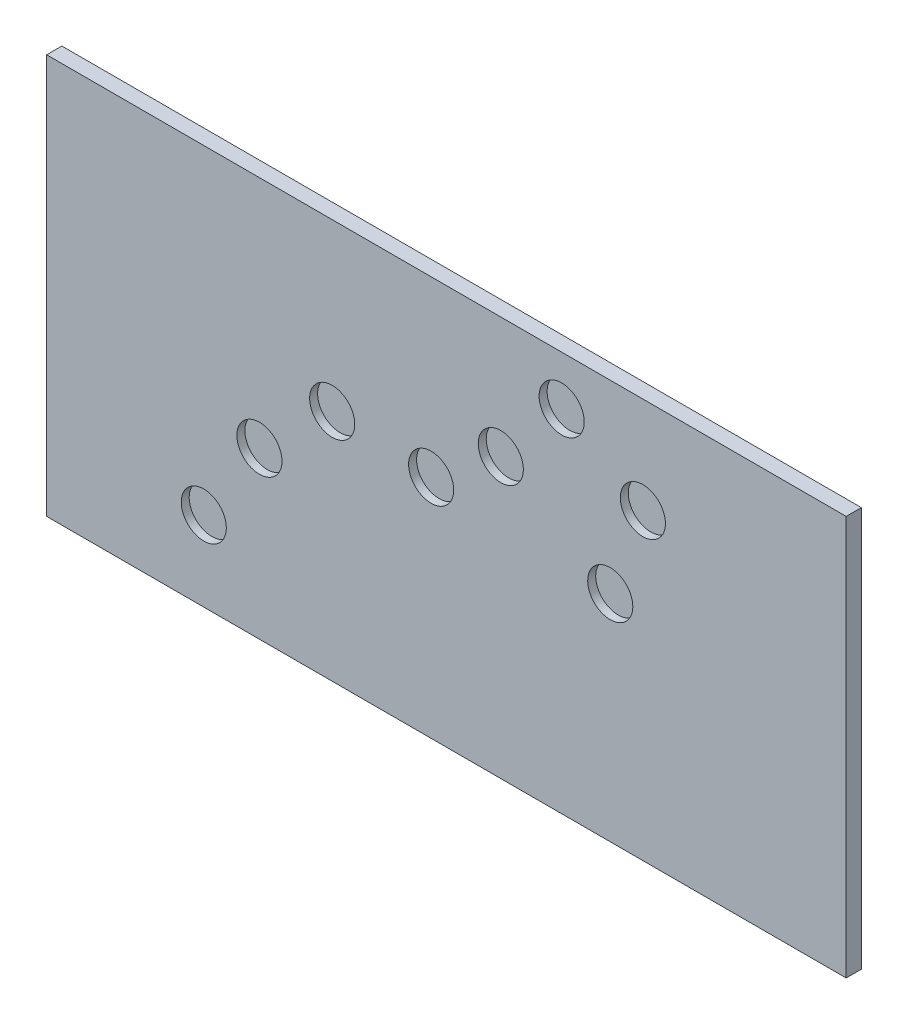
ISO-10303-21;
HEADER;
FILE_DESCRIPTION(('STEP AP214'),'2;1');
FILE_NAME('part.step','',(''),(''),'','','');
FILE_SCHEMA(('AUTOMOTIVE_DESIGN { 1 0 10303 214 1 1 1 1 }'));
ENDSEC;
DATA;
#1=APPLICATION_CONTEXT('core data for automotive mechanical design processes');
#2=APPLICATION_PROTOCOL_DEFINITION('international standard','automotive_design',2000,#1);
#3=PRODUCT_CONTEXT('',#1,'mechanical');
#4=PRODUCT('Part','Part','',(#3));
#5=PRODUCT_RELATED_PRODUCT_CATEGORY('part','',(#4));
#6=PRODUCT_DEFINITION_FORMATION('','',#4);
#7=PRODUCT_DEFINITION_CONTEXT('part definition',#1,'design');
#8=PRODUCT_DEFINITION('design','',#6,#7);
#9=PRODUCT_DEFINITION_SHAPE('','',#8);
#10=(LENGTH_UNIT() NAMED_UNIT(*) SI_UNIT(.MILLI.,.METRE.));
#11=(NAMED_UNIT(*) PLANE_ANGLE_UNIT() SI_UNIT($,.RADIAN.));
#12=(NAMED_UNIT(*) SI_UNIT($,.STERADIAN.) SOLID_ANGLE_UNIT());
#13=UNCERTAINTY_MEASURE_WITH_UNIT(LENGTH_MEASURE(1.E-05),#10,'distance_accuracy_value','');
#14=(GEOMETRIC_REPRESENTATION_CONTEXT(3) GLOBAL_UNCERTAINTY_ASSIGNED_CONTEXT((#13)) GLOBAL_UNIT_ASSIGNED_CONTEXT((#10,
#11,#12)) REPRESENTATION_CONTEXT('',''));
#15=CARTESIAN_POINT('',(0.,0.,0.));
#16=DIRECTION('',(0.,0.,1.));
#17=DIRECTION('',(1.,0.,0.));
#18=AXIS2_PLACEMENT_3D('',#15,#16,#17);
#19=CARTESIAN_POINT('',(0.,0.,19.));
#20=DIRECTION('',(1.,0.,0.));
#21=DIRECTION('',(0.,0.,-1.));
#22=AXIS2_PLACEMENT_3D('',#19,#20,#21);
#23=PLANE('',#22);
#24=DIRECTION('',(0.,-1.,0.));
#25=VECTOR('',#24,1.);
#26=CARTESIAN_POINT('',(0.,0.,0.));
#27=LINE('',#26,#25);
#28=CARTESIAN_POINT('',(0.,500.,0.));
#29=VERTEX_POINT('',#28);
#30=CARTESIAN_POINT('',(0.,0.,0.));
#31=VERTEX_POINT('',#30);
#32=EDGE_CURVE('E131',#29,#31,#27,.T.);
#33=ORIENTED_EDGE('',*,*,#32,.T.);
#34=DIRECTION('',(0.,0.,-1.));
#35=VECTOR('',#34,1.);
#36=CARTESIAN_POINT('',(0.,0.,19.));
#37=LINE('',#36,#35);
#38=CARTESIAN_POINT('',(0.,0.,19.));
#39=VERTEX_POINT('',#38);
#40=EDGE_CURVE('E13',#39,#31,#37,.T.);
#41=ORIENTED_EDGE('',*,*,#40,.F.);
#42=DIRECTION('',(0.,-1.,0.));
#43=VECTOR('',#42,1.);
#44=CARTESIAN_POINT('',(0.,0.,19.));
#45=LINE('',#44,#43);
#46=CARTESIAN_POINT('',(0.,500.,19.));
#47=VERTEX_POINT('',#46);
#48=EDGE_CURVE('E119',#47,#39,#45,.T.);
#49=ORIENTED_EDGE('',*,*,#48,.F.);
#50=DIRECTION('',(0.,0.,-1.));
#51=VECTOR('',#50,1.);
#52=CARTESIAN_POINT('',(0.,500.,19.));
#53=LINE('',#52,#51);
#54=EDGE_CURVE('E127',#47,#29,#53,.T.);
#55=ORIENTED_EDGE('',*,*,#54,.T.);
#56=EDGE_LOOP('',(#33,#41,#49,#55));
#57=FACE_BOUND('',#56,.T.);
#58=ADVANCED_FACE('F68',(#57),#23,.F.);
#59=CARTESIAN_POINT('',(0.,0.,19.));
#60=DIRECTION('',(0.,1.,0.));
#61=DIRECTION('',(0.,0.,1.));
#62=AXIS2_PLACEMENT_3D('',#59,#60,#61);
#63=PLANE('',#62);
#64=DIRECTION('',(1.,0.,0.));
#65=VECTOR('',#64,1.);
#66=CARTESIAN_POINT('',(0.,0.,0.));
#67=LINE('',#66,#65);
#68=CARTESIAN_POINT('',(1000.,0.,0.));
#69=VERTEX_POINT('',#68);
#70=EDGE_CURVE('E123',#31,#69,#67,.T.);
#71=ORIENTED_EDGE('',*,*,#70,.T.);
#72=DIRECTION('',(0.,0.,-1.));
#73=VECTOR('',#72,1.);
#74=CARTESIAN_POINT('',(1000.,0.,19.));
#75=LINE('',#74,#73);
#76=CARTESIAN_POINT('',(1000.,0.,19.));
#77=VERTEX_POINT('',#76);
#78=EDGE_CURVE('E76',#77,#69,#75,.T.);
#79=ORIENTED_EDGE('',*,*,#78,.F.);
#80=DIRECTION('',(1.,0.,0.));
#81=VECTOR('',#80,1.);
#82=CARTESIAN_POINT('',(0.,0.,19.));
#83=LINE('',#82,#81);
#84=EDGE_CURVE('E114',#39,#77,#83,.T.);
#85=ORIENTED_EDGE('',*,*,#84,.F.);
#86=ORIENTED_EDGE('',*,*,#40,.T.);
#87=EDGE_LOOP('',(#71,#79,#85,#86));
#88=FACE_BOUND('',#87,.T.);
#89=ADVANCED_FACE('F122',(#88),#63,.F.);
#90=CARTESIAN_POINT('',(1000.,0.,19.));
#91=DIRECTION('',(-1.,0.,0.));
#92=DIRECTION('',(0.,0.,1.));
#93=AXIS2_PLACEMENT_3D('',#90,#91,#92);
#94=PLANE('',#93);
#95=DIRECTION('',(0.,1.,0.));
#96=VECTOR('',#95,1.);
#97=CARTESIAN_POINT('',(1000.,0.,0.));
#98=LINE('',#97,#96);
#99=CARTESIAN_POINT('',(1000.,500.,0.));
#100=VERTEX_POINT('',#99);
#101=EDGE_CURVE('E101',#69,#100,#98,.T.);
#102=ORIENTED_EDGE('',*,*,#101,.T.);
#103=DIRECTION('',(0.,0.,-1.));
#104=VECTOR('',#103,1.);
#105=CARTESIAN_POINT('',(1000.,500.,19.));
#106=LINE('',#105,#104);
#107=CARTESIAN_POINT('',(1000.,500.,19.));
#108=VERTEX_POINT('',#107);
#109=EDGE_CURVE('E124',#108,#100,#106,.T.);
#110=ORIENTED_EDGE('',*,*,#109,.F.);
#111=DIRECTION('',(0.,1.,0.));
#112=VECTOR('',#111,1.);
#113=CARTESIAN_POINT('',(1000.,0.,19.));
#114=LINE('',#113,#112);
#115=EDGE_CURVE('E117',#77,#108,#114,.T.);
#116=ORIENTED_EDGE('',*,*,#115,.F.);
#117=ORIENTED_EDGE('',*,*,#78,.T.);
#118=EDGE_LOOP('',(#102,#110,#116,#117));
#119=FACE_BOUND('',#118,.T.);
#120=ADVANCED_FACE('F125',(#119),#94,.F.);
#121=CARTESIAN_POINT('',(0.,500.,19.));
#122=DIRECTION('',(0.,-1.,0.));
#123=DIRECTION('',(0.,0.,-1.));
#124=AXIS2_PLACEMENT_3D('',#121,#122,#123);
#125=PLANE('',#124);
#126=DIRECTION('',(-1.,0.,0.));
#127=VECTOR('',#126,1.);
#128=CARTESIAN_POINT('',(0.,500.,0.));
#129=LINE('',#128,#127);
#130=EDGE_CURVE('E107',#100,#29,#129,.T.);
#131=ORIENTED_EDGE('',*,*,#130,.T.);
#132=ORIENTED_EDGE('',*,*,#54,.F.);
#133=DIRECTION('',(-1.,0.,0.));
#134=VECTOR('',#133,1.);
#135=CARTESIAN_POINT('',(0.,500.,19.));
#136=LINE('',#135,#134);
#137=EDGE_CURVE('E84',#108,#47,#136,.T.);
#138=ORIENTED_EDGE('',*,*,#137,.F.);
#139=ORIENTED_EDGE('',*,*,#109,.T.);
#140=EDGE_LOOP('',(#131,#132,#138,#139));
#141=FACE_BOUND('',#140,.T.);
#142=ADVANCED_FACE('F139',(#141),#125,.F.);
#143=CARTESIAN_POINT('',(0.,500.,19.));
#144=DIRECTION('',(0.,0.,-1.));
#145=DIRECTION('',(-1.,0.,0.));
#146=AXIS2_PLACEMENT_3D('',#143,#144,#145);
#147=PLANE('',#146);
#148=CARTESIAN_POINT('',(357.149463479894,292.373242422048,19.));
#149=DIRECTION('',(0.,0.,1.));
#150=DIRECTION('',(0.798681998165496,-0.601753326377487,0.));
#151=AXIS2_PLACEMENT_3D('',#148,#149,#150);
#152=CIRCLE('',#151,28.2123499760019);
#153=CARTESIAN_POINT('',(379.682159531671,275.396366979063,19.));
#154=VERTEX_POINT('',#153);
#155=EDGE_CURVE('E185',#154,#154,#152,.T.);
#156=ORIENTED_EDGE('',*,*,#155,.F.);
#157=EDGE_LOOP('',(#156));
#158=FACE_BOUND('',#157,.T.);
#159=CARTESIAN_POINT('',(480.935862348049,282.89072122934,19.));
#160=DIRECTION('',(0.,0.,1.));
#161=DIRECTION('',(0.265853347136616,-0.964013484250224,0.));
#162=AXIS2_PLACEMENT_3D('',#159,#160,#161);
#163=CIRCLE('',#162,28.2123499760019);
#164=CARTESIAN_POINT('',(488.436210019759,255.693635430087,19.));
#165=VERTEX_POINT('',#164);
#166=EDGE_CURVE('E179',#165,#165,#163,.T.);
#167=ORIENTED_EDGE('',*,*,#166,.F.);
#168=EDGE_LOOP('',(#167));
#169=FACE_BOUND('',#168,.T.);
#170=CARTESIAN_POINT('',(568.014776537445,348.810476341382,19.));
#171=DIRECTION('',(0.,0.,1.));
#172=DIRECTION('',(0.841752833044578,0.539863101222363,0.));
#173=AXIS2_PLACEMENT_3D('',#170,#171,#172);
#174=CIRCLE('',#173,28.2123499760019);
#175=CARTESIAN_POINT('',(591.76260205659,364.041283092197,19.));
#176=VERTEX_POINT('',#175);
#177=EDGE_CURVE('E173',#176,#176,#174,.T.);
#178=ORIENTED_EDGE('',*,*,#177,.F.);
#179=EDGE_LOOP('',(#178));
#180=FACE_BOUND('',#179,.T.);
#181=CARTESIAN_POINT('',(644.156581304666,438.482891969957,19.));
#182=DIRECTION('',(0.,0.,1.));
#183=DIRECTION('',(0.678144469858808,-0.734928621023781,0.));
#184=AXIS2_PLACEMENT_3D('',#181,#182,#183);
#185=CIRCLE('',#184,28.2123499760019);
#186=CARTESIAN_POINT('',(663.288630422613,417.748828506254,19.));
#187=VERTEX_POINT('',#186);
#188=EDGE_CURVE('E167',#187,#187,#185,.T.);
#189=ORIENTED_EDGE('',*,*,#188,.F.);
#190=EDGE_LOOP('',(#189));
#191=FACE_BOUND('',#190,.T.);
#192=CARTESIAN_POINT('',(745.713948150023,379.112715978041,19.));
#193=DIRECTION('',(0.,0.,1.));
#194=DIRECTION('',(-0.605664723776337,-0.795719952227499,0.));
#195=AXIS2_PLACEMENT_3D('',#192,#193,#194);
#196=CIRCLE('',#195,28.2123499760019);
#197=CARTESIAN_POINT('',(728.626722994727,356.663586202912,19.));
#198=VERTEX_POINT('',#197);
#199=EDGE_CURVE('E160',#198,#198,#196,.T.);
#200=ORIENTED_EDGE('',*,*,#199,.F.);
#201=EDGE_LOOP('',(#200));
#202=FACE_BOUND('',#201,.T.);
#203=CARTESIAN_POINT('',(704.928159374163,268.771264148711,19.));
#204=DIRECTION('',(0.,0.,1.));
#205=DIRECTION('',(-0.88899959858468,0.457907975161252,0.));
#206=AXIS2_PLACEMENT_3D('',#203,#204,#205);
#207=CIRCLE('',#206,28.2123499760019);
#208=CARTESIAN_POINT('',(679.847391570366,281.689924200763,19.));
#209=VERTEX_POINT('',#208);
#210=EDGE_CURVE('E161',#209,#209,#207,.T.);
#211=ORIENTED_EDGE('',*,*,#210,.F.);
#212=EDGE_LOOP('',(#211));
#213=FACE_BOUND('',#212,.T.);
#214=CARTESIAN_POINT('',(266.151257789515,206.876350005216,19.));
#215=DIRECTION('',(0.,0.,1.));
#216=DIRECTION('',(1.,0.,0.));
#217=AXIS2_PLACEMENT_3D('',#214,#215,#216);
#218=CIRCLE('',#217,28.2123499760019);
#219=CARTESIAN_POINT('',(294.363607765517,206.876350005216,19.));
#220=VERTEX_POINT('',#219);
#221=EDGE_CURVE('E153',#220,#220,#218,.T.);
#222=ORIENTED_EDGE('',*,*,#221,.F.);
#223=EDGE_LOOP('',(#222));
#224=FACE_BOUND('',#223,.T.);
#225=CARTESIAN_POINT('',(196.527870487984,99.7537968748645,19.));
#226=DIRECTION('',(0.,0.,1.));
#227=DIRECTION('',(1.,0.,0.));
#228=AXIS2_PLACEMENT_3D('',#225,#226,#227);
#229=CIRCLE('',#228,28.2123499760019);
#230=CARTESIAN_POINT('',(224.740220463985,99.7537968748645,19.));
#231=VERTEX_POINT('',#230);
#232=EDGE_CURVE('E145',#231,#231,#229,.T.);
#233=ORIENTED_EDGE('',*,*,#232,.F.);
#234=EDGE_LOOP('',(#233));
#235=FACE_BOUND('',#234,.T.);
#236=ORIENTED_EDGE('',*,*,#48,.T.);
#237=ORIENTED_EDGE('',*,*,#84,.T.);
#238=ORIENTED_EDGE('',*,*,#115,.T.);
#239=ORIENTED_EDGE('',*,*,#137,.T.);
#240=EDGE_LOOP('',(#236,#237,#238,#239));
#241=FACE_BOUND('',#240,.T.);
#242=ADVANCED_FACE('F115',(#158,#169,#180,#191,#202,#213,#224,#235,#241),#147,.F.);
#243=CARTESIAN_POINT('',(0.,500.,0.));
#244=DIRECTION('',(0.,0.,-1.));
#245=DIRECTION('',(-1.,0.,0.));
#246=AXIS2_PLACEMENT_3D('',#243,#244,#245);
#247=PLANE('',#246);
#248=ORIENTED_EDGE('',*,*,#32,.F.);
#249=ORIENTED_EDGE('',*,*,#130,.F.);
#250=ORIENTED_EDGE('',*,*,#101,.F.);
#251=ORIENTED_EDGE('',*,*,#70,.F.);
#252=EDGE_LOOP('',(#248,#249,#250,#251));
#253=FACE_BOUND('',#252,.T.);
#254=ADVANCED_FACE('F142',(#253),#247,.T.);
#255=CARTESIAN_POINT('',(196.527870487984,99.7537968748645,9.));
#256=DIRECTION('',(0.,0.,1.));
#257=DIRECTION('',(1.,0.,0.));
#258=AXIS2_PLACEMENT_3D('',#255,#256,#257);
#259=CYLINDRICAL_SURFACE('',#258,28.2123499760019);
#260=CARTESIAN_POINT('',(196.527870487984,99.7537968748645,9.));
#261=DIRECTION('',(0.,0.,1.));
#262=DIRECTION('',(1.,0.,0.));
#263=AXIS2_PLACEMENT_3D('',#260,#261,#262);
#264=CIRCLE('',#263,28.2123499760019);
#265=CARTESIAN_POINT('',(224.740220463985,99.7537968748645,9.));
#266=VERTEX_POINT('',#265);
#267=EDGE_CURVE('E134',#266,#266,#264,.T.);
#268=ORIENTED_EDGE('',*,*,#267,.F.);
#269=EDGE_LOOP('',(#268));
#270=FACE_BOUND('',#269,.T.);
#271=ORIENTED_EDGE('',*,*,#232,.T.);
#272=EDGE_LOOP('',(#271));
#273=FACE_BOUND('',#272,.T.);
#274=ADVANCED_FACE('F212',(#270,#273),#259,.F.);
#275=CARTESIAN_POINT('',(196.527870487984,99.7537968748645,9.));
#276=DIRECTION('',(0.,0.,1.));
#277=DIRECTION('',(1.,0.,0.));
#278=AXIS2_PLACEMENT_3D('',#275,#276,#277);
#279=PLANE('',#278);
#280=ORIENTED_EDGE('',*,*,#267,.T.);
#281=EDGE_LOOP('',(#280));
#282=FACE_BOUND('',#281,.T.);
#283=ADVANCED_FACE('F214',(#282),#279,.T.);
#284=CARTESIAN_POINT('',(266.151257789515,206.876350005216,9.00000000000003));
#285=DIRECTION('',(0.,0.,1.));
#286=DIRECTION('',(1.,0.,0.));
#287=AXIS2_PLACEMENT_3D('',#284,#285,#286);
#288=CYLINDRICAL_SURFACE('',#287,28.2123499760019);
#289=CARTESIAN_POINT('',(266.151257789515,206.876350005216,9.00000000000003));
#290=DIRECTION('',(0.,0.,1.));
#291=DIRECTION('',(1.,0.,0.));
#292=AXIS2_PLACEMENT_3D('',#289,#290,#291);
#293=CIRCLE('',#292,28.2123499760019);
#294=CARTESIAN_POINT('',(294.363607765517,206.876350005216,9.00000000000003));
#295=VERTEX_POINT('',#294);
#296=EDGE_CURVE('E148',#295,#295,#293,.T.);
#297=ORIENTED_EDGE('',*,*,#296,.F.);
#298=EDGE_LOOP('',(#297));
#299=FACE_BOUND('',#298,.T.);
#300=ORIENTED_EDGE('',*,*,#221,.T.);
#301=EDGE_LOOP('',(#300));
#302=FACE_BOUND('',#301,.T.);
#303=ADVANCED_FACE('F221',(#299,#302),#288,.F.);
#304=CARTESIAN_POINT('',(266.151257789515,206.876350005216,9.00000000000003));
#305=DIRECTION('',(0.,0.,1.));
#306=DIRECTION('',(1.,0.,0.));
#307=AXIS2_PLACEMENT_3D('',#304,#305,#306);
#308=PLANE('',#307);
#309=ORIENTED_EDGE('',*,*,#296,.T.);
#310=EDGE_LOOP('',(#309));
#311=FACE_BOUND('',#310,.T.);
#312=ADVANCED_FACE('F267',(#311),#308,.T.);
#313=CARTESIAN_POINT('',(704.928159374163,268.771264148711,9.00000000000003));
#314=DIRECTION('',(0.,0.,1.));
#315=DIRECTION('',(-0.88899959858468,0.457907975161252,0.));
#316=AXIS2_PLACEMENT_3D('',#313,#314,#315);
#317=CYLINDRICAL_SURFACE('',#316,28.2123499760019);
#318=CARTESIAN_POINT('',(704.928159374163,268.771264148711,9.00000000000003));
#319=DIRECTION('',(0.,0.,1.));
#320=DIRECTION('',(-0.88899959858468,0.457907975161252,0.));
#321=AXIS2_PLACEMENT_3D('',#318,#319,#320);
#322=CIRCLE('',#321,28.2123499760019);
#323=CARTESIAN_POINT('',(679.847391570366,281.689924200763,9.00000000000003));
#324=VERTEX_POINT('',#323);
#325=EDGE_CURVE('E157',#324,#324,#322,.T.);
#326=ORIENTED_EDGE('',*,*,#325,.F.);
#327=EDGE_LOOP('',(#326));
#328=FACE_BOUND('',#327,.T.);
#329=ORIENTED_EDGE('',*,*,#210,.T.);
#330=EDGE_LOOP('',(#329));
#331=FACE_BOUND('',#330,.T.);
#332=ADVANCED_FACE('F274',(#328,#331),#317,.F.);
#333=CARTESIAN_POINT('',(704.928159374163,268.771264148711,9.00000000000003));
#334=DIRECTION('',(0.,0.,1.));
#335=DIRECTION('',(-0.88899959858468,0.457907975161252,0.));
#336=AXIS2_PLACEMENT_3D('',#333,#334,#335);
#337=PLANE('',#336);
#338=ORIENTED_EDGE('',*,*,#325,.T.);
#339=EDGE_LOOP('',(#338));
#340=FACE_BOUND('',#339,.T.);
#341=ADVANCED_FACE('F282',(#340),#337,.T.);
#342=CARTESIAN_POINT('',(745.713948150023,379.112715978041,9.00000000000003));
#343=DIRECTION('',(0.,0.,1.));
#344=DIRECTION('',(-0.605664723776337,-0.795719952227499,0.));
#345=AXIS2_PLACEMENT_3D('',#342,#343,#344);
#346=CYLINDRICAL_SURFACE('',#345,28.2123499760019);
#347=CARTESIAN_POINT('',(745.713948150023,379.112715978041,9.00000000000003));
#348=DIRECTION('',(0.,0.,1.));
#349=DIRECTION('',(-0.605664723776337,-0.795719952227499,0.));
#350=AXIS2_PLACEMENT_3D('',#347,#348,#349);
#351=CIRCLE('',#350,28.2123499760019);
#352=CARTESIAN_POINT('',(728.626722994727,356.663586202912,9.00000000000003));
#353=VERTEX_POINT('',#352);
#354=EDGE_CURVE('E164',#353,#353,#351,.T.);
#355=ORIENTED_EDGE('',*,*,#354,.F.);
#356=EDGE_LOOP('',(#355));
#357=FACE_BOUND('',#356,.T.);
#358=ORIENTED_EDGE('',*,*,#199,.T.);
#359=EDGE_LOOP('',(#358));
#360=FACE_BOUND('',#359,.T.);
#361=ADVANCED_FACE('F290',(#357,#360),#346,.F.);
#362=CARTESIAN_POINT('',(745.713948150023,379.112715978041,9.00000000000003));
#363=DIRECTION('',(0.,0.,1.));
#364=DIRECTION('',(-0.605664723776337,-0.795719952227499,0.));
#365=AXIS2_PLACEMENT_3D('',#362,#363,#364);
#366=PLANE('',#365);
#367=ORIENTED_EDGE('',*,*,#354,.T.);
#368=EDGE_LOOP('',(#367));
#369=FACE_BOUND('',#368,.T.);
#370=ADVANCED_FACE('F298',(#369),#366,.T.);
#371=CARTESIAN_POINT('',(644.156581304666,438.482891969957,9.00000000000003));
#372=DIRECTION('',(0.,0.,1.));
#373=DIRECTION('',(0.678144469858808,-0.734928621023781,0.));
#374=AXIS2_PLACEMENT_3D('',#371,#372,#373);
#375=CYLINDRICAL_SURFACE('',#374,28.2123499760019);
#376=CARTESIAN_POINT('',(644.156581304666,438.482891969957,9.00000000000003));
#377=DIRECTION('',(0.,0.,1.));
#378=DIRECTION('',(0.678144469858808,-0.734928621023781,0.));
#379=AXIS2_PLACEMENT_3D('',#376,#377,#378);
#380=CIRCLE('',#379,28.2123499760019);
#381=CARTESIAN_POINT('',(663.288630422613,417.748828506254,9.00000000000003));
#382=VERTEX_POINT('',#381);
#383=EDGE_CURVE('E170',#382,#382,#380,.T.);
#384=ORIENTED_EDGE('',*,*,#383,.F.);
#385=EDGE_LOOP('',(#384));
#386=FACE_BOUND('',#385,.T.);
#387=ORIENTED_EDGE('',*,*,#188,.T.);
#388=EDGE_LOOP('',(#387));
#389=FACE_BOUND('',#388,.T.);
#390=ADVANCED_FACE('F306',(#386,#389),#375,.F.);
#391=CARTESIAN_POINT('',(644.156581304666,438.482891969957,9.00000000000003));
#392=DIRECTION('',(0.,0.,1.));
#393=DIRECTION('',(0.678144469858808,-0.734928621023781,0.));
#394=AXIS2_PLACEMENT_3D('',#391,#392,#393);
#395=PLANE('',#394);
#396=ORIENTED_EDGE('',*,*,#383,.T.);
#397=EDGE_LOOP('',(#396));
#398=FACE_BOUND('',#397,.T.);
#399=ADVANCED_FACE('F314',(#398),#395,.T.);
#400=CARTESIAN_POINT('',(568.014776537445,348.810476341382,9.00000000000003));
#401=DIRECTION('',(0.,0.,1.));
#402=DIRECTION('',(0.841752833044578,0.539863101222363,0.));
#403=AXIS2_PLACEMENT_3D('',#400,#401,#402);
#404=CYLINDRICAL_SURFACE('',#403,28.2123499760019);
#405=CARTESIAN_POINT('',(568.014776537445,348.810476341382,9.00000000000003));
#406=DIRECTION('',(0.,0.,1.));
#407=DIRECTION('',(0.841752833044578,0.539863101222363,0.));
#408=AXIS2_PLACEMENT_3D('',#405,#406,#407);
#409=CIRCLE('',#408,28.2123499760019);
#410=CARTESIAN_POINT('',(591.76260205659,364.041283092197,9.00000000000003));
#411=VERTEX_POINT('',#410);
#412=EDGE_CURVE('E176',#411,#411,#409,.T.);
#413=ORIENTED_EDGE('',*,*,#412,.F.);
#414=EDGE_LOOP('',(#413));
#415=FACE_BOUND('',#414,.T.);
#416=ORIENTED_EDGE('',*,*,#177,.T.);
#417=EDGE_LOOP('',(#416));
#418=FACE_BOUND('',#417,.T.);
#419=ADVANCED_FACE('F322',(#415,#418),#404,.F.);
#420=CARTESIAN_POINT('',(568.014776537445,348.810476341382,9.00000000000003));
#421=DIRECTION('',(0.,0.,1.));
#422=DIRECTION('',(0.841752833044578,0.539863101222363,0.));
#423=AXIS2_PLACEMENT_3D('',#420,#421,#422);
#424=PLANE('',#423);
#425=ORIENTED_EDGE('',*,*,#412,.T.);
#426=EDGE_LOOP('',(#425));
#427=FACE_BOUND('',#426,.T.);
#428=ADVANCED_FACE('F330',(#427),#424,.T.);
#429=CARTESIAN_POINT('',(480.935862348049,282.89072122934,9.00000000000003));
#430=DIRECTION('',(0.,0.,1.));
#431=DIRECTION('',(0.265853347136616,-0.964013484250224,0.));
#432=AXIS2_PLACEMENT_3D('',#429,#430,#431);
#433=CYLINDRICAL_SURFACE('',#432,28.2123499760019);
#434=CARTESIAN_POINT('',(480.935862348049,282.89072122934,9.00000000000003));
#435=DIRECTION('',(0.,0.,1.));
#436=DIRECTION('',(0.265853347136616,-0.964013484250224,0.));
#437=AXIS2_PLACEMENT_3D('',#434,#435,#436);
#438=CIRCLE('',#437,28.2123499760019);
#439=CARTESIAN_POINT('',(488.436210019759,255.693635430087,9.00000000000003));
#440=VERTEX_POINT('',#439);
#441=EDGE_CURVE('E182',#440,#440,#438,.T.);
#442=ORIENTED_EDGE('',*,*,#441,.F.);
#443=EDGE_LOOP('',(#442));
#444=FACE_BOUND('',#443,.T.);
#445=ORIENTED_EDGE('',*,*,#166,.T.);
#446=EDGE_LOOP('',(#445));
#447=FACE_BOUND('',#446,.T.);
#448=ADVANCED_FACE('F338',(#444,#447),#433,.F.);
#449=CARTESIAN_POINT('',(480.935862348049,282.89072122934,9.00000000000003));
#450=DIRECTION('',(0.,0.,1.));
#451=DIRECTION('',(0.265853347136616,-0.964013484250224,0.));
#452=AXIS2_PLACEMENT_3D('',#449,#450,#451);
#453=PLANE('',#452);
#454=ORIENTED_EDGE('',*,*,#441,.T.);
#455=EDGE_LOOP('',(#454));
#456=FACE_BOUND('',#455,.T.);
#457=ADVANCED_FACE('F346',(#456),#453,.T.);
#458=CARTESIAN_POINT('',(357.149463479894,292.373242422048,9.00000000000004));
#459=DIRECTION('',(0.,0.,1.));
#460=DIRECTION('',(0.798681998165496,-0.601753326377487,0.));
#461=AXIS2_PLACEMENT_3D('',#458,#459,#460);
#462=CYLINDRICAL_SURFACE('',#461,28.2123499760019);
#463=CARTESIAN_POINT('',(357.149463479894,292.373242422048,9.00000000000004));
#464=DIRECTION('',(0.,0.,1.));
#465=DIRECTION('',(0.798681998165496,-0.601753326377487,0.));
#466=AXIS2_PLACEMENT_3D('',#463,#464,#465);
#467=CIRCLE('',#466,28.2123499760019);
#468=CARTESIAN_POINT('',(379.682159531671,275.396366979063,9.00000000000004));
#469=VERTEX_POINT('',#468);
#470=EDGE_CURVE('E156',#469,#469,#467,.T.);
#471=ORIENTED_EDGE('',*,*,#470,.F.);
#472=EDGE_LOOP('',(#471));
#473=FACE_BOUND('',#472,.T.);
#474=ORIENTED_EDGE('',*,*,#155,.T.);
#475=EDGE_LOOP('',(#474));
#476=FACE_BOUND('',#475,.T.);
#477=ADVANCED_FACE('F193',(#473,#476),#462,.F.);
#478=CARTESIAN_POINT('',(357.149463479894,292.373242422048,9.00000000000004));
#479=DIRECTION('',(0.,0.,1.));
#480=DIRECTION('',(0.798681998165496,-0.601753326377487,0.));
#481=AXIS2_PLACEMENT_3D('',#478,#479,#480);
#482=PLANE('',#481);
#483=ORIENTED_EDGE('',*,*,#470,.T.);
#484=EDGE_LOOP('',(#483));
#485=FACE_BOUND('',#484,.T.);
#486=ADVANCED_FACE('F361',(#485),#482,.T.);
#487=CLOSED_SHELL('',(#58,#89,#120,#142,#242,#254,#274,#283,#303,#312,#332,#341,#361,#370,#390,
#399,#419,#428,#448,#457,#477,#486));
#488=MANIFOLD_SOLID_BREP('B2',#487);
#489=ADVANCED_BREP_SHAPE_REPRESENTATION('',(#18,#488),#14);
#490=SHAPE_DEFINITION_REPRESENTATION(#9,#489);
ENDSEC;
END-ISO-10303-21;
